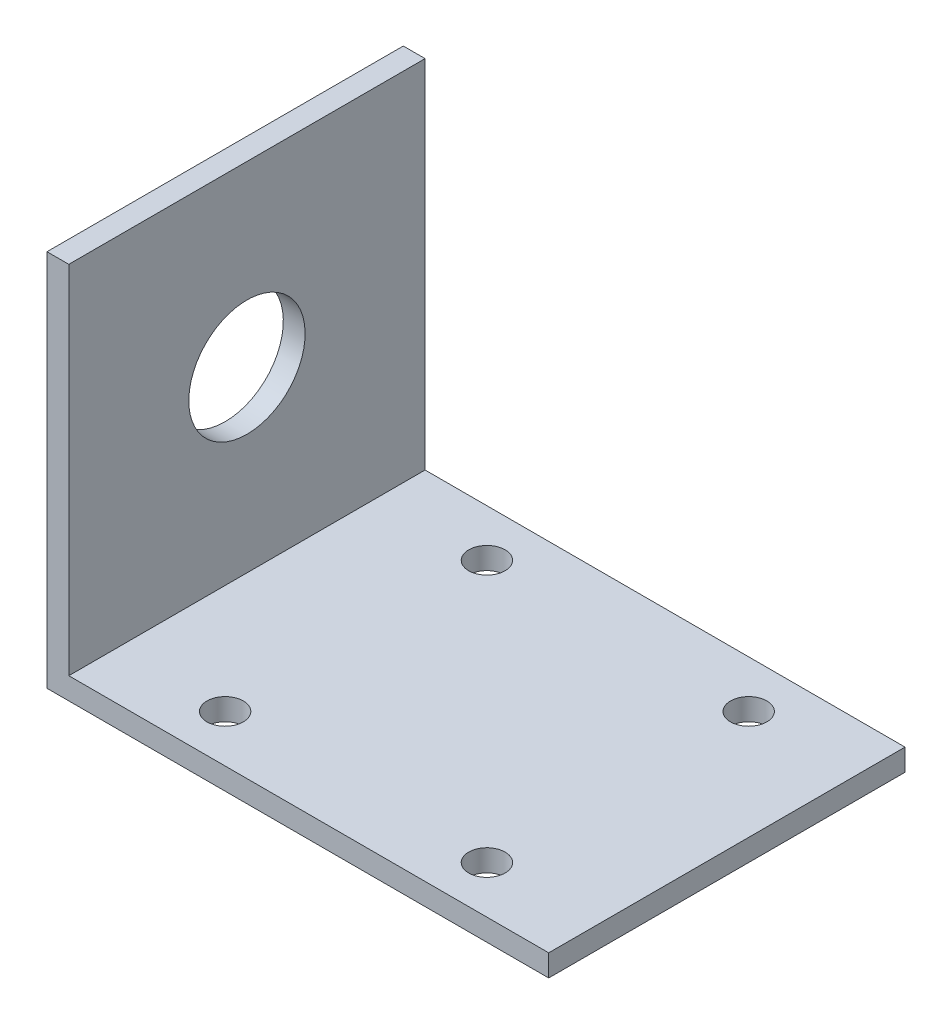
ISO-10303-21;
HEADER;
FILE_DESCRIPTION(('STEP AP214'),'2;1');
FILE_NAME('part.step','',(''),(''),'','','');
FILE_SCHEMA(('AUTOMOTIVE_DESIGN { 1 0 10303 214 1 1 1 1 }'));
ENDSEC;
DATA;
#1=APPLICATION_CONTEXT('core data for automotive mechanical design processes');
#2=APPLICATION_PROTOCOL_DEFINITION('international standard','automotive_design',2000,#1);
#3=PRODUCT_CONTEXT('',#1,'mechanical');
#4=PRODUCT('Part','Part','',(#3));
#5=PRODUCT_RELATED_PRODUCT_CATEGORY('part','',(#4));
#6=PRODUCT_DEFINITION_FORMATION('','',#4);
#7=PRODUCT_DEFINITION_CONTEXT('part definition',#1,'design');
#8=PRODUCT_DEFINITION('design','',#6,#7);
#9=PRODUCT_DEFINITION_SHAPE('','',#8);
#10=(LENGTH_UNIT() NAMED_UNIT(*) SI_UNIT(.MILLI.,.METRE.));
#11=(NAMED_UNIT(*) PLANE_ANGLE_UNIT() SI_UNIT($,.RADIAN.));
#12=(NAMED_UNIT(*) SI_UNIT($,.STERADIAN.) SOLID_ANGLE_UNIT());
#13=UNCERTAINTY_MEASURE_WITH_UNIT(LENGTH_MEASURE(1.E-05),#10,'distance_accuracy_value','');
#14=(GEOMETRIC_REPRESENTATION_CONTEXT(3) GLOBAL_UNCERTAINTY_ASSIGNED_CONTEXT((#13)) GLOBAL_UNIT_ASSIGNED_CONTEXT((#10,
#11,#12)) REPRESENTATION_CONTEXT('',''));
#15=CARTESIAN_POINT('',(0.,0.,0.));
#16=DIRECTION('',(0.,0.,1.));
#17=DIRECTION('',(1.,0.,0.));
#18=AXIS2_PLACEMENT_3D('',#15,#16,#17);
#19=CARTESIAN_POINT('',(-19.5644326731834,30.2319587628866,49.));
#20=DIRECTION('',(0.,-1.,0.));
#21=DIRECTION('',(0.,0.,-1.));
#22=AXIS2_PLACEMENT_3D('',#19,#20,#21);
#23=PLANE('',#22);
#24=DIRECTION('',(-1.,0.,0.));
#25=VECTOR('',#24,1.);
#26=CARTESIAN_POINT('',(-19.5644326731834,30.2319587628866,0.));
#27=LINE('',#26,#25);
#28=CARTESIAN_POINT('',(-19.5644326731834,30.2319587628866,0.));
#29=VERTEX_POINT('',#28);
#30=CARTESIAN_POINT('',(-22.5644326731834,30.2319587628866,0.));
#31=VERTEX_POINT('',#30);
#32=EDGE_CURVE('E120',#29,#31,#27,.T.);
#33=ORIENTED_EDGE('',*,*,#32,.T.);
#34=DIRECTION('',(0.,0.,-1.));
#35=VECTOR('',#34,1.);
#36=CARTESIAN_POINT('',(-22.5644326731834,30.2319587628866,49.));
#37=LINE('',#36,#35);
#38=CARTESIAN_POINT('',(-22.5644326731834,30.2319587628866,49.));
#39=VERTEX_POINT('',#38);
#40=EDGE_CURVE('E11',#39,#31,#37,.T.);
#41=ORIENTED_EDGE('',*,*,#40,.F.);
#42=DIRECTION('',(-1.,0.,0.));
#43=VECTOR('',#42,1.);
#44=CARTESIAN_POINT('',(-19.5644326731834,30.2319587628866,49.));
#45=LINE('',#44,#43);
#46=CARTESIAN_POINT('',(-19.5644326731834,30.2319587628866,49.));
#47=VERTEX_POINT('',#46);
#48=EDGE_CURVE('E131',#47,#39,#45,.T.);
#49=ORIENTED_EDGE('',*,*,#48,.F.);
#50=DIRECTION('',(0.,0.,-1.));
#51=VECTOR('',#50,1.);
#52=CARTESIAN_POINT('',(-19.5644326731834,30.2319587628866,49.));
#53=LINE('',#52,#51);
#54=EDGE_CURVE('E116',#47,#29,#53,.T.);
#55=ORIENTED_EDGE('',*,*,#54,.T.);
#56=EDGE_LOOP('',(#33,#41,#49,#55));
#57=FACE_BOUND('',#56,.T.);
#58=ADVANCED_FACE('F35',(#57),#23,.F.);
#59=CARTESIAN_POINT('',(-22.5644326731834,30.2319587628866,49.));
#60=DIRECTION('',(1.,0.,0.));
#61=DIRECTION('',(0.,1.,0.));
#62=AXIS2_PLACEMENT_3D('',#59,#60,#61);
#63=PLANE('',#62);
#64=CARTESIAN_POINT('',(-22.5644326731833,5.73195876288659,24.5));
#65=DIRECTION('',(-1.,0.,0.));
#66=DIRECTION('',(0.,-1.,0.));
#67=AXIS2_PLACEMENT_3D('',#64,#65,#66);
#68=CIRCLE('',#67,8.);
#69=CARTESIAN_POINT('',(-22.5644326731833,-2.26804123711341,24.5));
#70=VERTEX_POINT('',#69);
#71=EDGE_CURVE('E260',#70,#70,#68,.T.);
#72=ORIENTED_EDGE('',*,*,#71,.F.);
#73=EDGE_LOOP('',(#72));
#74=FACE_BOUND('',#73,.T.);
#75=DIRECTION('',(0.,-1.,0.));
#76=VECTOR('',#75,1.);
#77=CARTESIAN_POINT('',(-22.5644326731834,30.2319587628866,0.));
#78=LINE('',#77,#76);
#79=CARTESIAN_POINT('',(-22.5644326731833,-21.7680412371134,0.));
#80=VERTEX_POINT('',#79);
#81=EDGE_CURVE('E123',#31,#80,#78,.T.);
#82=ORIENTED_EDGE('',*,*,#81,.T.);
#83=DIRECTION('',(0.,0.,-1.));
#84=VECTOR('',#83,1.);
#85=CARTESIAN_POINT('',(-22.5644326731833,-21.7680412371134,49.));
#86=LINE('',#85,#84);
#87=CARTESIAN_POINT('',(-22.5644326731833,-21.7680412371134,49.));
#88=VERTEX_POINT('',#87);
#89=EDGE_CURVE('E44',#88,#80,#86,.T.);
#90=ORIENTED_EDGE('',*,*,#89,.F.);
#91=DIRECTION('',(0.,-1.,0.));
#92=VECTOR('',#91,1.);
#93=CARTESIAN_POINT('',(-22.5644326731834,30.2319587628866,49.));
#94=LINE('',#93,#92);
#95=EDGE_CURVE('E89',#39,#88,#94,.T.);
#96=ORIENTED_EDGE('',*,*,#95,.F.);
#97=ORIENTED_EDGE('',*,*,#40,.T.);
#98=EDGE_LOOP('',(#82,#90,#96,#97));
#99=FACE_BOUND('',#98,.T.);
#100=ADVANCED_FACE('F159',(#74,#99),#63,.F.);
#101=CARTESIAN_POINT('',(-22.5644326731833,-21.7680412371134,49.));
#102=DIRECTION('',(0.,1.,0.));
#103=DIRECTION('',(0.,0.,1.));
#104=AXIS2_PLACEMENT_3D('',#101,#102,#103);
#105=PLANE('',#104);
#106=CARTESIAN_POINT('',(31.4355673268166,-21.7680412371134,6.5));
#107=DIRECTION('',(0.,1.,0.));
#108=DIRECTION('',(0.,0.,1.));
#109=AXIS2_PLACEMENT_3D('',#106,#107,#108);
#110=CIRCLE('',#109,2.5);
#111=CARTESIAN_POINT('',(31.4355673268166,-21.7680412371134,9.));
#112=VERTEX_POINT('',#111);
#113=EDGE_CURVE('E124',#112,#112,#110,.T.);
#114=ORIENTED_EDGE('',*,*,#113,.T.);
#115=EDGE_LOOP('',(#114));
#116=FACE_BOUND('',#115,.T.);
#117=CARTESIAN_POINT('',(-4.56443267318333,-21.7680412371134,42.5));
#118=DIRECTION('',(0.,1.,0.));
#119=DIRECTION('',(0.,0.,1.));
#120=AXIS2_PLACEMENT_3D('',#117,#118,#119);
#121=CIRCLE('',#120,2.5);
#122=CARTESIAN_POINT('',(-4.56443267318333,-21.7680412371134,45.));
#123=VERTEX_POINT('',#122);
#124=EDGE_CURVE('E282',#123,#123,#121,.T.);
#125=ORIENTED_EDGE('',*,*,#124,.T.);
#126=EDGE_LOOP('',(#125));
#127=FACE_BOUND('',#126,.T.);
#128=CARTESIAN_POINT('',(31.4355673268167,-21.7680412371134,42.5));
#129=DIRECTION('',(0.,1.,0.));
#130=DIRECTION('',(0.,0.,1.));
#131=AXIS2_PLACEMENT_3D('',#128,#129,#130);
#132=CIRCLE('',#131,2.5);
#133=CARTESIAN_POINT('',(31.4355673268167,-21.7680412371134,45.));
#134=VERTEX_POINT('',#133);
#135=EDGE_CURVE('E279',#134,#134,#132,.T.);
#136=ORIENTED_EDGE('',*,*,#135,.T.);
#137=EDGE_LOOP('',(#136));
#138=FACE_BOUND('',#137,.T.);
#139=CARTESIAN_POINT('',(-4.56443267318333,-21.7680412371134,6.5));
#140=DIRECTION('',(0.,1.,0.));
#141=DIRECTION('',(0.,0.,1.));
#142=AXIS2_PLACEMENT_3D('',#139,#140,#141);
#143=CIRCLE('',#142,2.5);
#144=CARTESIAN_POINT('',(-4.56443267318333,-21.7680412371134,9.));
#145=VERTEX_POINT('',#144);
#146=EDGE_CURVE('E276',#145,#145,#143,.T.);
#147=ORIENTED_EDGE('',*,*,#146,.T.);
#148=EDGE_LOOP('',(#147));
#149=FACE_BOUND('',#148,.T.);
#150=DIRECTION('',(1.,0.,0.));
#151=VECTOR('',#150,1.);
#152=CARTESIAN_POINT('',(-22.5644326731833,-21.7680412371134,0.));
#153=LINE('',#152,#151);
#154=CARTESIAN_POINT('',(46.4355673268167,-21.7680412371134,0.));
#155=VERTEX_POINT('',#154);
#156=EDGE_CURVE('E126',#80,#155,#153,.T.);
#157=ORIENTED_EDGE('',*,*,#156,.T.);
#158=DIRECTION('',(0.,0.,-1.));
#159=VECTOR('',#158,1.);
#160=CARTESIAN_POINT('',(46.4355673268167,-21.7680412371134,49.));
#161=LINE('',#160,#159);
#162=CARTESIAN_POINT('',(46.4355673268167,-21.7680412371134,49.));
#163=VERTEX_POINT('',#162);
#164=EDGE_CURVE('E111',#163,#155,#161,.T.);
#165=ORIENTED_EDGE('',*,*,#164,.F.);
#166=DIRECTION('',(1.,0.,0.));
#167=VECTOR('',#166,1.);
#168=CARTESIAN_POINT('',(-22.5644326731833,-21.7680412371134,49.));
#169=LINE('',#168,#167);
#170=EDGE_CURVE('E102',#88,#163,#169,.T.);
#171=ORIENTED_EDGE('',*,*,#170,.F.);
#172=ORIENTED_EDGE('',*,*,#89,.T.);
#173=EDGE_LOOP('',(#157,#165,#171,#172));
#174=FACE_BOUND('',#173,.T.);
#175=ADVANCED_FACE('F138',(#116,#127,#138,#149,#174),#105,.F.);
#176=CARTESIAN_POINT('',(46.4355673268167,-21.7680412371134,49.));
#177=DIRECTION('',(-1.,0.,0.));
#178=DIRECTION('',(0.,0.,1.));
#179=AXIS2_PLACEMENT_3D('',#176,#177,#178);
#180=PLANE('',#179);
#181=DIRECTION('',(0.,1.,0.));
#182=VECTOR('',#181,1.);
#183=CARTESIAN_POINT('',(46.4355673268167,-21.7680412371134,0.));
#184=LINE('',#183,#182);
#185=CARTESIAN_POINT('',(46.4355673268167,-18.7680412371134,0.));
#186=VERTEX_POINT('',#185);
#187=EDGE_CURVE('E110',#155,#186,#184,.T.);
#188=ORIENTED_EDGE('',*,*,#187,.T.);
#189=DIRECTION('',(0.,0.,-1.));
#190=VECTOR('',#189,1.);
#191=CARTESIAN_POINT('',(46.4355673268167,-18.7680412371134,49.));
#192=LINE('',#191,#190);
#193=CARTESIAN_POINT('',(46.4355673268167,-18.7680412371134,49.));
#194=VERTEX_POINT('',#193);
#195=EDGE_CURVE('E107',#194,#186,#192,.T.);
#196=ORIENTED_EDGE('',*,*,#195,.F.);
#197=DIRECTION('',(0.,1.,0.));
#198=VECTOR('',#197,1.);
#199=CARTESIAN_POINT('',(46.4355673268167,-21.7680412371134,49.));
#200=LINE('',#199,#198);
#201=EDGE_CURVE('E96',#163,#194,#200,.T.);
#202=ORIENTED_EDGE('',*,*,#201,.F.);
#203=ORIENTED_EDGE('',*,*,#164,.T.);
#204=EDGE_LOOP('',(#188,#196,#202,#203));
#205=FACE_BOUND('',#204,.T.);
#206=ADVANCED_FACE('F108',(#205),#180,.F.);
#207=CARTESIAN_POINT('',(46.4355673268167,-18.7680412371134,49.));
#208=DIRECTION('',(0.,-1.,0.));
#209=DIRECTION('',(1.,0.,0.));
#210=AXIS2_PLACEMENT_3D('',#207,#208,#209);
#211=PLANE('',#210);
#212=CARTESIAN_POINT('',(31.4355673268166,-18.7680412371134,6.5));
#213=DIRECTION('',(0.,1.,0.));
#214=DIRECTION('',(-1.,0.,0.));
#215=AXIS2_PLACEMENT_3D('',#212,#213,#214);
#216=CIRCLE('',#215,2.5);
#217=CARTESIAN_POINT('',(28.9355673268166,-18.7680412371134,6.5));
#218=VERTEX_POINT('',#217);
#219=EDGE_CURVE('E268',#218,#218,#216,.T.);
#220=ORIENTED_EDGE('',*,*,#219,.F.);
#221=EDGE_LOOP('',(#220));
#222=FACE_BOUND('',#221,.T.);
#223=CARTESIAN_POINT('',(-4.56443267318333,-18.7680412371134,42.5));
#224=DIRECTION('',(0.,1.,0.));
#225=DIRECTION('',(-1.,0.,0.));
#226=AXIS2_PLACEMENT_3D('',#223,#224,#225);
#227=CIRCLE('',#226,2.5);
#228=CARTESIAN_POINT('',(-7.06443267318333,-18.7680412371134,42.5));
#229=VERTEX_POINT('',#228);
#230=EDGE_CURVE('E264',#229,#229,#227,.T.);
#231=ORIENTED_EDGE('',*,*,#230,.F.);
#232=EDGE_LOOP('',(#231));
#233=FACE_BOUND('',#232,.T.);
#234=CARTESIAN_POINT('',(31.4355673268167,-18.7680412371134,42.5));
#235=DIRECTION('',(0.,1.,0.));
#236=DIRECTION('',(-1.,0.,0.));
#237=AXIS2_PLACEMENT_3D('',#234,#235,#236);
#238=CIRCLE('',#237,2.5);
#239=CARTESIAN_POINT('',(28.9355673268167,-18.7680412371134,42.5));
#240=VERTEX_POINT('',#239);
#241=EDGE_CURVE('E262',#240,#240,#238,.T.);
#242=ORIENTED_EDGE('',*,*,#241,.F.);
#243=EDGE_LOOP('',(#242));
#244=FACE_BOUND('',#243,.T.);
#245=CARTESIAN_POINT('',(-4.56443267318333,-18.7680412371134,6.5));
#246=DIRECTION('',(0.,1.,0.));
#247=DIRECTION('',(-1.,0.,0.));
#248=AXIS2_PLACEMENT_3D('',#245,#246,#247);
#249=CIRCLE('',#248,2.5);
#250=CARTESIAN_POINT('',(-7.06443267318333,-18.7680412371134,6.5));
#251=VERTEX_POINT('',#250);
#252=EDGE_CURVE('E271',#251,#251,#249,.T.);
#253=ORIENTED_EDGE('',*,*,#252,.F.);
#254=EDGE_LOOP('',(#253));
#255=FACE_BOUND('',#254,.T.);
#256=DIRECTION('',(-1.,0.,0.));
#257=VECTOR('',#256,1.);
#258=CARTESIAN_POINT('',(46.4355673268167,-18.7680412371134,0.));
#259=LINE('',#258,#257);
#260=CARTESIAN_POINT('',(-19.5644326731834,-18.7680412371134,0.));
#261=VERTEX_POINT('',#260);
#262=EDGE_CURVE('E75',#186,#261,#259,.T.);
#263=ORIENTED_EDGE('',*,*,#262,.T.);
#264=DIRECTION('',(0.,0.,-1.));
#265=VECTOR('',#264,1.);
#266=CARTESIAN_POINT('',(-19.5644326731834,-18.7680412371134,49.));
#267=LINE('',#266,#265);
#268=CARTESIAN_POINT('',(-19.5644326731834,-18.7680412371134,49.));
#269=VERTEX_POINT('',#268);
#270=EDGE_CURVE('E112',#269,#261,#267,.T.);
#271=ORIENTED_EDGE('',*,*,#270,.F.);
#272=DIRECTION('',(-1.,0.,0.));
#273=VECTOR('',#272,1.);
#274=CARTESIAN_POINT('',(46.4355673268167,-18.7680412371134,49.));
#275=LINE('',#274,#273);
#276=EDGE_CURVE('E100',#194,#269,#275,.T.);
#277=ORIENTED_EDGE('',*,*,#276,.F.);
#278=ORIENTED_EDGE('',*,*,#195,.T.);
#279=EDGE_LOOP('',(#263,#271,#277,#278));
#280=FACE_BOUND('',#279,.T.);
#281=ADVANCED_FACE('F114',(#222,#233,#244,#255,#280),#211,.F.);
#282=CARTESIAN_POINT('',(-19.5644326731834,-18.7680412371134,49.));
#283=DIRECTION('',(-1.,0.,0.));
#284=DIRECTION('',(0.,-1.,0.));
#285=AXIS2_PLACEMENT_3D('',#282,#283,#284);
#286=PLANE('',#285);
#287=CARTESIAN_POINT('',(-19.5644326731834,5.73195876288659,24.5));
#288=DIRECTION('',(-1.,0.,0.));
#289=DIRECTION('',(0.,-1.,0.));
#290=AXIS2_PLACEMENT_3D('',#287,#288,#289);
#291=CIRCLE('',#290,8.);
#292=CARTESIAN_POINT('',(-19.5644326731834,-2.26804123711341,24.5));
#293=VERTEX_POINT('',#292);
#294=EDGE_CURVE('E38',#293,#293,#291,.T.);
#295=ORIENTED_EDGE('',*,*,#294,.T.);
#296=EDGE_LOOP('',(#295));
#297=FACE_BOUND('',#296,.T.);
#298=DIRECTION('',(0.,1.,0.));
#299=VECTOR('',#298,1.);
#300=CARTESIAN_POINT('',(-19.5644326731834,-18.7680412371134,0.));
#301=LINE('',#300,#299);
#302=EDGE_CURVE('E81',#261,#29,#301,.T.);
#303=ORIENTED_EDGE('',*,*,#302,.T.);
#304=ORIENTED_EDGE('',*,*,#54,.F.);
#305=DIRECTION('',(0.,1.,0.));
#306=VECTOR('',#305,1.);
#307=CARTESIAN_POINT('',(-19.5644326731834,-18.7680412371134,49.));
#308=LINE('',#307,#306);
#309=EDGE_CURVE('E52',#269,#47,#308,.T.);
#310=ORIENTED_EDGE('',*,*,#309,.F.);
#311=ORIENTED_EDGE('',*,*,#270,.T.);
#312=EDGE_LOOP('',(#303,#304,#310,#311));
#313=FACE_BOUND('',#312,.T.);
#314=ADVANCED_FACE('F145',(#297,#313),#286,.F.);
#315=CARTESIAN_POINT('',(0.,0.,49.));
#316=DIRECTION('',(0.,0.,1.));
#317=DIRECTION('',(1.,0.,0.));
#318=AXIS2_PLACEMENT_3D('',#315,#316,#317);
#319=PLANE('',#318);
#320=ORIENTED_EDGE('',*,*,#48,.T.);
#321=ORIENTED_EDGE('',*,*,#95,.T.);
#322=ORIENTED_EDGE('',*,*,#170,.T.);
#323=ORIENTED_EDGE('',*,*,#201,.T.);
#324=ORIENTED_EDGE('',*,*,#276,.T.);
#325=ORIENTED_EDGE('',*,*,#309,.T.);
#326=EDGE_LOOP('',(#320,#321,#322,#323,#324,#325));
#327=FACE_BOUND('',#326,.T.);
#328=ADVANCED_FACE('F98',(#327),#319,.T.);
#329=CARTESIAN_POINT('',(0.,0.,0.));
#330=DIRECTION('',(0.,0.,1.));
#331=DIRECTION('',(1.,0.,0.));
#332=AXIS2_PLACEMENT_3D('',#329,#330,#331);
#333=PLANE('',#332);
#334=ORIENTED_EDGE('',*,*,#32,.F.);
#335=ORIENTED_EDGE('',*,*,#302,.F.);
#336=ORIENTED_EDGE('',*,*,#262,.F.);
#337=ORIENTED_EDGE('',*,*,#187,.F.);
#338=ORIENTED_EDGE('',*,*,#156,.F.);
#339=ORIENTED_EDGE('',*,*,#81,.F.);
#340=EDGE_LOOP('',(#334,#335,#336,#337,#338,#339));
#341=FACE_BOUND('',#340,.T.);
#342=ADVANCED_FACE('F141',(#341),#333,.F.);
#343=CARTESIAN_POINT('',(-4.56443267318333,-67.7680412371134,6.5));
#344=DIRECTION('',(0.,1.,0.));
#345=DIRECTION('',(-1.,0.,0.));
#346=AXIS2_PLACEMENT_3D('',#343,#344,#345);
#347=CYLINDRICAL_SURFACE('',#346,2.5);
#348=ORIENTED_EDGE('',*,*,#252,.T.);
#349=EDGE_LOOP('',(#348));
#350=FACE_BOUND('',#349,.T.);
#351=ORIENTED_EDGE('',*,*,#146,.F.);
#352=EDGE_LOOP('',(#351));
#353=FACE_BOUND('',#352,.T.);
#354=ADVANCED_FACE('F190',(#350,#353),#347,.F.);
#355=CARTESIAN_POINT('',(31.4355673268167,-67.7680412371134,42.5));
#356=DIRECTION('',(0.,1.,0.));
#357=DIRECTION('',(-1.,0.,0.));
#358=AXIS2_PLACEMENT_3D('',#355,#356,#357);
#359=CYLINDRICAL_SURFACE('',#358,2.5);
#360=ORIENTED_EDGE('',*,*,#241,.T.);
#361=EDGE_LOOP('',(#360));
#362=FACE_BOUND('',#361,.T.);
#363=ORIENTED_EDGE('',*,*,#135,.F.);
#364=EDGE_LOOP('',(#363));
#365=FACE_BOUND('',#364,.T.);
#366=ADVANCED_FACE('F195',(#362,#365),#359,.F.);
#367=CARTESIAN_POINT('',(-4.56443267318333,-67.7680412371134,42.5));
#368=DIRECTION('',(0.,1.,0.));
#369=DIRECTION('',(-1.,0.,0.));
#370=AXIS2_PLACEMENT_3D('',#367,#368,#369);
#371=CYLINDRICAL_SURFACE('',#370,2.5);
#372=ORIENTED_EDGE('',*,*,#230,.T.);
#373=EDGE_LOOP('',(#372));
#374=FACE_BOUND('',#373,.T.);
#375=ORIENTED_EDGE('',*,*,#124,.F.);
#376=EDGE_LOOP('',(#375));
#377=FACE_BOUND('',#376,.T.);
#378=ADVANCED_FACE('F207',(#374,#377),#371,.F.);
#379=CARTESIAN_POINT('',(31.4355673268166,-67.7680412371134,6.5));
#380=DIRECTION('',(0.,1.,0.));
#381=DIRECTION('',(-1.,0.,0.));
#382=AXIS2_PLACEMENT_3D('',#379,#380,#381);
#383=CYLINDRICAL_SURFACE('',#382,2.5);
#384=ORIENTED_EDGE('',*,*,#219,.T.);
#385=EDGE_LOOP('',(#384));
#386=FACE_BOUND('',#385,.T.);
#387=ORIENTED_EDGE('',*,*,#113,.F.);
#388=EDGE_LOOP('',(#387));
#389=FACE_BOUND('',#388,.T.);
#390=ADVANCED_FACE('F217',(#386,#389),#383,.F.);
#391=CARTESIAN_POINT('',(26.4355673268167,5.7319587628866,24.5));
#392=DIRECTION('',(-1.,0.,0.));
#393=DIRECTION('',(0.,-1.,0.));
#394=AXIS2_PLACEMENT_3D('',#391,#392,#393);
#395=CYLINDRICAL_SURFACE('',#394,8.);
#396=ORIENTED_EDGE('',*,*,#71,.T.);
#397=EDGE_LOOP('',(#396));
#398=FACE_BOUND('',#397,.T.);
#399=ORIENTED_EDGE('',*,*,#294,.F.);
#400=EDGE_LOOP('',(#399));
#401=FACE_BOUND('',#400,.T.);
#402=ADVANCED_FACE('F226',(#398,#401),#395,.F.);
#403=CLOSED_SHELL('',(#58,#100,#175,#206,#281,#314,#328,#342,#354,#366,#378,#390,#402));
#404=MANIFOLD_SOLID_BREP('B2',#403);
#405=ADVANCED_BREP_SHAPE_REPRESENTATION('',(#18,#404),#14);
#406=SHAPE_DEFINITION_REPRESENTATION(#9,#405);
ENDSEC;
END-ISO-10303-21;
